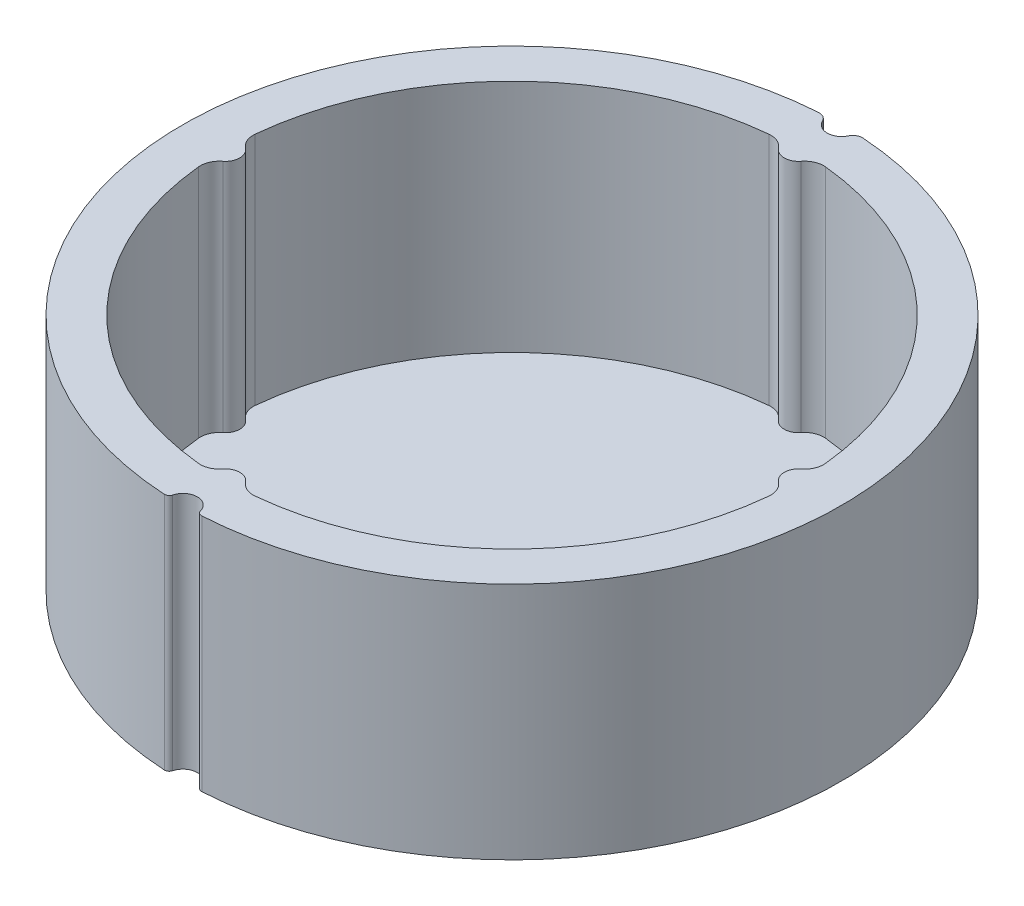
ISO-10303-21;
HEADER;
FILE_DESCRIPTION(('STEP AP214'),'2;1');
FILE_NAME('part.step','',(''),(''),'','','');
FILE_SCHEMA(('AUTOMOTIVE_DESIGN { 1 0 10303 214 1 1 1 1 }'));
ENDSEC;
DATA;
#1=APPLICATION_CONTEXT('core data for automotive mechanical design processes');
#2=APPLICATION_PROTOCOL_DEFINITION('international standard','automotive_design',2000,#1);
#3=PRODUCT_CONTEXT('',#1,'mechanical');
#4=PRODUCT('Part','Part','',(#3));
#5=PRODUCT_RELATED_PRODUCT_CATEGORY('part','',(#4));
#6=PRODUCT_DEFINITION_FORMATION('','',#4);
#7=PRODUCT_DEFINITION_CONTEXT('part definition',#1,'design');
#8=PRODUCT_DEFINITION('design','',#6,#7);
#9=PRODUCT_DEFINITION_SHAPE('','',#8);
#10=(LENGTH_UNIT() NAMED_UNIT(*) SI_UNIT(.MILLI.,.METRE.));
#11=(NAMED_UNIT(*) PLANE_ANGLE_UNIT() SI_UNIT($,.RADIAN.));
#12=(NAMED_UNIT(*) SI_UNIT($,.STERADIAN.) SOLID_ANGLE_UNIT());
#13=UNCERTAINTY_MEASURE_WITH_UNIT(LENGTH_MEASURE(1.E-05),#10,'distance_accuracy_value','');
#14=(GEOMETRIC_REPRESENTATION_CONTEXT(3) GLOBAL_UNCERTAINTY_ASSIGNED_CONTEXT((#13)) GLOBAL_UNIT_ASSIGNED_CONTEXT((#10,
#11,#12)) REPRESENTATION_CONTEXT('',''));
#15=CARTESIAN_POINT('',(0.,0.,0.));
#16=DIRECTION('',(0.,0.,1.));
#17=DIRECTION('',(1.,0.,0.));
#18=AXIS2_PLACEMENT_3D('',#15,#16,#17);
#19=CARTESIAN_POINT('',(0.,25.,0.));
#20=DIRECTION('',(0.,1.,0.));
#21=DIRECTION('',(0.,0.,1.));
#22=AXIS2_PLACEMENT_3D('',#19,#20,#21);
#23=PLANE('',#22);
#24=CARTESIAN_POINT('',(-1.93575856721061,25.,33.9428491683965));
#25=DIRECTION('',(0.,1.,0.));
#26=DIRECTION('',(0.,0.,1.));
#27=AXIS2_PLACEMENT_3D('',#24,#25,#26);
#28=CIRCLE('',#27,0.500000000000003);
#29=CARTESIAN_POINT('',(-1.45181892540796,25.,34.0685568574689));
#30=VERTEX_POINT('',#29);
#31=CARTESIAN_POINT('',(-1.96422560496371,25.,34.4420381383884));
#32=VERTEX_POINT('',#31);
#33=EDGE_CURVE('E338',#30,#32,#28,.F.);
#34=ORIENTED_EDGE('',*,*,#33,.F.);
#35=CARTESIAN_POINT('',(0.,25.,34.4456799246862));
#36=DIRECTION('',(0.,1.,0.));
#37=DIRECTION('',(0.,0.,1.));
#38=AXIS2_PLACEMENT_3D('',#35,#36,#37);
#39=CIRCLE('',#38,1.50000000000002);
#40=CARTESIAN_POINT('',(1.45181892540796,25.,34.0685568574689));
#41=VERTEX_POINT('',#40);
#42=EDGE_CURVE('E342',#41,#30,#39,.T.);
#43=ORIENTED_EDGE('',*,*,#42,.F.);
#44=CARTESIAN_POINT('',(1.93575856721061,25.,33.9428491683965));
#45=DIRECTION('',(0.,1.,0.));
#46=DIRECTION('',(0.,0.,1.));
#47=AXIS2_PLACEMENT_3D('',#44,#45,#46);
#48=CIRCLE('',#47,0.500000000000003);
#49=CARTESIAN_POINT('',(1.9642256049637,25.,34.4420381383884));
#50=VERTEX_POINT('',#49);
#51=EDGE_CURVE('E347',#41,#50,#48,.T.);
#52=ORIENTED_EDGE('',*,*,#51,.T.);
#53=CARTESIAN_POINT('',(0.,25.,-0.0020007910519898));
#54=DIRECTION('',(0.,1.,0.));
#55=DIRECTION('',(0.,0.,1.));
#56=AXIS2_PLACEMENT_3D('',#53,#54,#55);
#57=CIRCLE('',#56,34.5);
#58=CARTESIAN_POINT('',(2.32413582105506,25.,-34.4236276074198));
#59=VERTEX_POINT('',#58);
#60=EDGE_CURVE('E350',#50,#59,#57,.T.);
#61=ORIENTED_EDGE('',*,*,#60,.T.);
#62=CARTESIAN_POINT('',(2.2567695653723,25.,-33.4258992939019));
#63=DIRECTION('',(0.,1.,0.));
#64=DIRECTION('',(0.,0.,1.));
#65=AXIS2_PLACEMENT_3D('',#62,#63,#64);
#66=CIRCLE('',#65,1.);
#67=CARTESIAN_POINT('',(1.35406173922335,25.,-33.8561533823304));
#68=VERTEX_POINT('',#67);
#69=EDGE_CURVE('E353',#68,#59,#66,.F.);
#70=ORIENTED_EDGE('',*,*,#69,.F.);
#71=CARTESIAN_POINT('',(0.,25.,-34.5015345149731));
#72=DIRECTION('',(0.,1.,0.));
#73=DIRECTION('',(0.,0.,1.));
#74=AXIS2_PLACEMENT_3D('',#71,#72,#73);
#75=CIRCLE('',#74,1.49999999999991);
#76=CARTESIAN_POINT('',(-1.35406173922335,25.,-33.8561533823304));
#77=VERTEX_POINT('',#76);
#78=EDGE_CURVE('E357',#77,#68,#75,.T.);
#79=ORIENTED_EDGE('',*,*,#78,.F.);
#80=CARTESIAN_POINT('',(-2.2567695653723,25.,-33.4258992939019));
#81=DIRECTION('',(0.,1.,0.));
#82=DIRECTION('',(0.,0.,1.));
#83=AXIS2_PLACEMENT_3D('',#80,#81,#82);
#84=CIRCLE('',#83,1.);
#85=CARTESIAN_POINT('',(-2.32413582105505,25.,-34.4236276074198));
#86=VERTEX_POINT('',#85);
#87=EDGE_CURVE('E361',#77,#86,#84,.T.);
#88=ORIENTED_EDGE('',*,*,#87,.T.);
#89=CARTESIAN_POINT('',(0.,25.,-0.0020007910519898));
#90=DIRECTION('',(0.,1.,0.));
#91=DIRECTION('',(0.,0.,1.));
#92=AXIS2_PLACEMENT_3D('',#89,#90,#91);
#93=CIRCLE('',#92,34.5);
#94=EDGE_CURVE('E364',#86,#32,#93,.T.);
#95=ORIENTED_EDGE('',*,*,#94,.T.);
#96=EDGE_LOOP('',(#34,#43,#52,#61,#70,#79,#88,#95));
#97=FACE_BOUND('',#96,.T.);
#98=CARTESIAN_POINT('',(0.,25.,0.));
#99=DIRECTION('',(0.,1.,0.));
#100=DIRECTION('',(0.,0.,1.));
#101=AXIS2_PLACEMENT_3D('',#98,#99,#100);
#102=CIRCLE('',#101,30.);
#103=CARTESIAN_POINT('',(-29.8526785714286,25.,2.96944138028848));
#104=VERTEX_POINT('',#103);
#105=CARTESIAN_POINT('',(-2.96944138028845,25.,29.8526785714286));
#106=VERTEX_POINT('',#105);
#107=EDGE_CURVE('E233',#104,#106,#102,.T.);
#108=ORIENTED_EDGE('',*,*,#107,.F.);
#109=CARTESIAN_POINT('',(-27.8625,25.,2.7714786216026));
#110=DIRECTION('',(0.,1.,0.));
#111=DIRECTION('',(0.,0.,1.));
#112=AXIS2_PLACEMENT_3D('',#109,#110,#111);
#113=CIRCLE('',#112,2.);
#114=CARTESIAN_POINT('',(-29.0839285714286,25.,1.18777655211542));
#115=VERTEX_POINT('',#114);
#116=EDGE_CURVE('E229',#115,#104,#113,.T.);
#117=ORIENTED_EDGE('',*,*,#116,.F.);
#118=CARTESIAN_POINT('',(-30.,25.,0.));
#119=DIRECTION('',(0.,-1.,0.));
#120=DIRECTION('',(0.,0.,1.));
#121=AXIS2_PLACEMENT_3D('',#118,#119,#120);
#122=CIRCLE('',#121,1.50000000000004);
#123=CARTESIAN_POINT('',(-29.0839285714286,25.,-1.18777655211542));
#124=VERTEX_POINT('',#123);
#125=EDGE_CURVE('E211',#124,#115,#122,.T.);
#126=ORIENTED_EDGE('',*,*,#125,.F.);
#127=CARTESIAN_POINT('',(-27.8625,25.,-2.7714786216026));
#128=DIRECTION('',(0.,1.,0.));
#129=DIRECTION('',(0.,0.,-1.));
#130=AXIS2_PLACEMENT_3D('',#127,#128,#129);
#131=CIRCLE('',#130,2.);
#132=CARTESIAN_POINT('',(-29.8526785714286,25.,-2.9694413802885));
#133=VERTEX_POINT('',#132);
#134=EDGE_CURVE('E277',#133,#124,#131,.T.);
#135=ORIENTED_EDGE('',*,*,#134,.F.);
#136=CARTESIAN_POINT('',(0.,25.,0.));
#137=DIRECTION('',(0.,1.,0.));
#138=DIRECTION('',(0.,0.,1.));
#139=AXIS2_PLACEMENT_3D('',#136,#137,#138);
#140=CIRCLE('',#139,30.);
#141=CARTESIAN_POINT('',(-2.96944138028845,25.,-29.8526785714286));
#142=VERTEX_POINT('',#141);
#143=EDGE_CURVE('E274',#142,#133,#140,.T.);
#144=ORIENTED_EDGE('',*,*,#143,.F.);
#145=CARTESIAN_POINT('',(-2.77147862160256,25.,-27.8625));
#146=DIRECTION('',(0.,1.,0.));
#147=DIRECTION('',(0.,0.,1.));
#148=AXIS2_PLACEMENT_3D('',#145,#146,#147);
#149=CIRCLE('',#148,2.);
#150=CARTESIAN_POINT('',(-1.18777655211538,25.,-29.0839285714286));
#151=VERTEX_POINT('',#150);
#152=EDGE_CURVE('E271',#151,#142,#149,.T.);
#153=ORIENTED_EDGE('',*,*,#152,.F.);
#154=CARTESIAN_POINT('',(0.,25.,-30.));
#155=DIRECTION('',(0.,-1.,0.));
#156=DIRECTION('',(0.,0.,1.));
#157=AXIS2_PLACEMENT_3D('',#154,#155,#156);
#158=CIRCLE('',#157,1.5);
#159=CARTESIAN_POINT('',(1.18777655211538,25.,-29.0839285714286));
#160=VERTEX_POINT('',#159);
#161=EDGE_CURVE('E268',#160,#151,#158,.T.);
#162=ORIENTED_EDGE('',*,*,#161,.F.);
#163=CARTESIAN_POINT('',(2.77147862160256,25.,-27.8625));
#164=DIRECTION('',(0.,1.,0.));
#165=DIRECTION('',(0.,0.,-1.));
#166=AXIS2_PLACEMENT_3D('',#163,#164,#165);
#167=CIRCLE('',#166,2.);
#168=CARTESIAN_POINT('',(2.96944138028846,25.,-29.8526785714286));
#169=VERTEX_POINT('',#168);
#170=EDGE_CURVE('E265',#169,#160,#167,.T.);
#171=ORIENTED_EDGE('',*,*,#170,.F.);
#172=CARTESIAN_POINT('',(0.,25.,0.));
#173=DIRECTION('',(0.,1.,0.));
#174=DIRECTION('',(0.,0.,1.));
#175=AXIS2_PLACEMENT_3D('',#172,#173,#174);
#176=CIRCLE('',#175,30.);
#177=CARTESIAN_POINT('',(29.8526785714286,25.,-2.96944138028845));
#178=VERTEX_POINT('',#177);
#179=EDGE_CURVE('E262',#178,#169,#176,.T.);
#180=ORIENTED_EDGE('',*,*,#179,.F.);
#181=CARTESIAN_POINT('',(27.8625,25.,-2.77147862160256));
#182=DIRECTION('',(0.,1.,0.));
#183=DIRECTION('',(0.,0.,1.));
#184=AXIS2_PLACEMENT_3D('',#181,#182,#183);
#185=CIRCLE('',#184,2.);
#186=CARTESIAN_POINT('',(29.0839285714286,25.,-1.18777655211538));
#187=VERTEX_POINT('',#186);
#188=EDGE_CURVE('E259',#187,#178,#185,.T.);
#189=ORIENTED_EDGE('',*,*,#188,.F.);
#190=CARTESIAN_POINT('',(30.,25.,0.));
#191=DIRECTION('',(0.,-1.,0.));
#192=DIRECTION('',(0.,0.,1.));
#193=AXIS2_PLACEMENT_3D('',#190,#191,#192);
#194=CIRCLE('',#193,1.5);
#195=CARTESIAN_POINT('',(29.0839285714286,25.,1.18777655211538));
#196=VERTEX_POINT('',#195);
#197=EDGE_CURVE('E256',#196,#187,#194,.T.);
#198=ORIENTED_EDGE('',*,*,#197,.F.);
#199=CARTESIAN_POINT('',(27.8625,25.,2.77147862160256));
#200=DIRECTION('',(0.,1.,0.));
#201=DIRECTION('',(0.,0.,-1.));
#202=AXIS2_PLACEMENT_3D('',#199,#200,#201);
#203=CIRCLE('',#202,2.);
#204=CARTESIAN_POINT('',(29.8526785714286,25.,2.96944138028846));
#205=VERTEX_POINT('',#204);
#206=EDGE_CURVE('E253',#205,#196,#203,.T.);
#207=ORIENTED_EDGE('',*,*,#206,.F.);
#208=CARTESIAN_POINT('',(0.,25.,0.));
#209=DIRECTION('',(0.,1.,0.));
#210=DIRECTION('',(0.,0.,1.));
#211=AXIS2_PLACEMENT_3D('',#208,#209,#210);
#212=CIRCLE('',#211,30.);
#213=CARTESIAN_POINT('',(2.96944138028845,25.,29.8526785714286));
#214=VERTEX_POINT('',#213);
#215=EDGE_CURVE('E250',#214,#205,#212,.T.);
#216=ORIENTED_EDGE('',*,*,#215,.F.);
#217=CARTESIAN_POINT('',(2.77147862160256,25.,27.8625));
#218=DIRECTION('',(0.,1.,0.));
#219=DIRECTION('',(0.,0.,1.));
#220=AXIS2_PLACEMENT_3D('',#217,#218,#219);
#221=CIRCLE('',#220,2.);
#222=CARTESIAN_POINT('',(1.18777655211538,25.,29.0839285714286));
#223=VERTEX_POINT('',#222);
#224=EDGE_CURVE('E247',#223,#214,#221,.T.);
#225=ORIENTED_EDGE('',*,*,#224,.F.);
#226=CARTESIAN_POINT('',(0.,25.,30.));
#227=DIRECTION('',(0.,-1.,0.));
#228=DIRECTION('',(0.,0.,1.));
#229=AXIS2_PLACEMENT_3D('',#226,#227,#228);
#230=CIRCLE('',#229,1.5);
#231=CARTESIAN_POINT('',(-1.18777655211538,25.,29.0839285714286));
#232=VERTEX_POINT('',#231);
#233=EDGE_CURVE('E244',#232,#223,#230,.T.);
#234=ORIENTED_EDGE('',*,*,#233,.F.);
#235=CARTESIAN_POINT('',(-2.77147862160256,25.,27.8625));
#236=DIRECTION('',(0.,1.,0.));
#237=DIRECTION('',(0.,0.,-1.));
#238=AXIS2_PLACEMENT_3D('',#235,#236,#237);
#239=CIRCLE('',#238,2.);
#240=EDGE_CURVE('E241',#106,#232,#239,.T.);
#241=ORIENTED_EDGE('',*,*,#240,.F.);
#242=EDGE_LOOP('',(#108,#117,#126,#135,#144,#153,#162,#171,#180,#189,#198,#207,#216,#225,#234,#241));
#243=FACE_BOUND('',#242,.T.);
#244=ADVANCED_FACE('F41',(#97,#243),#23,.T.);
#245=CARTESIAN_POINT('',(0.,0.,0.));
#246=DIRECTION('',(0.,1.,0.));
#247=DIRECTION('',(0.,0.,1.));
#248=AXIS2_PLACEMENT_3D('',#245,#246,#247);
#249=PLANE('',#248);
#250=CARTESIAN_POINT('',(-1.93575856721061,0.,33.9428491683965));
#251=DIRECTION('',(0.,1.,0.));
#252=DIRECTION('',(0.,0.,1.));
#253=AXIS2_PLACEMENT_3D('',#250,#251,#252);
#254=CIRCLE('',#253,0.500000000000003);
#255=CARTESIAN_POINT('',(-1.45181892540796,0.,34.0685568574689));
#256=VERTEX_POINT('',#255);
#257=CARTESIAN_POINT('',(-1.96422560496371,0.,34.4420381383884));
#258=VERTEX_POINT('',#257);
#259=EDGE_CURVE('E337',#256,#258,#254,.F.);
#260=ORIENTED_EDGE('',*,*,#259,.T.);
#261=CARTESIAN_POINT('',(0.,0.,-0.0020007910519898));
#262=DIRECTION('',(0.,1.,0.));
#263=DIRECTION('',(0.,0.,1.));
#264=AXIS2_PLACEMENT_3D('',#261,#262,#263);
#265=CIRCLE('',#264,34.5);
#266=CARTESIAN_POINT('',(-2.32413582105505,0.,-34.4236276074198));
#267=VERTEX_POINT('',#266);
#268=EDGE_CURVE('E343',#267,#258,#265,.T.);
#269=ORIENTED_EDGE('',*,*,#268,.F.);
#270=CARTESIAN_POINT('',(-2.2567695653723,0.,-33.4258992939019));
#271=DIRECTION('',(0.,1.,0.));
#272=DIRECTION('',(0.,0.,1.));
#273=AXIS2_PLACEMENT_3D('',#270,#271,#272);
#274=CIRCLE('',#273,1.);
#275=CARTESIAN_POINT('',(-1.35406173922335,0.,-33.8561533823304));
#276=VERTEX_POINT('',#275);
#277=EDGE_CURVE('E390',#276,#267,#274,.T.);
#278=ORIENTED_EDGE('',*,*,#277,.F.);
#279=CARTESIAN_POINT('',(0.,0.,-34.5015345149731));
#280=DIRECTION('',(0.,1.,0.));
#281=DIRECTION('',(0.,0.,1.));
#282=AXIS2_PLACEMENT_3D('',#279,#280,#281);
#283=CIRCLE('',#282,1.49999999999991);
#284=CARTESIAN_POINT('',(1.35406173922335,0.,-33.8561533823304));
#285=VERTEX_POINT('',#284);
#286=EDGE_CURVE('E386',#276,#285,#283,.T.);
#287=ORIENTED_EDGE('',*,*,#286,.T.);
#288=CARTESIAN_POINT('',(2.2567695653723,0.,-33.4258992939019));
#289=DIRECTION('',(0.,1.,0.));
#290=DIRECTION('',(0.,0.,1.));
#291=AXIS2_PLACEMENT_3D('',#288,#289,#290);
#292=CIRCLE('',#291,1.);
#293=CARTESIAN_POINT('',(2.32413582105506,0.,-34.4236276074198));
#294=VERTEX_POINT('',#293);
#295=EDGE_CURVE('E382',#285,#294,#292,.F.);
#296=ORIENTED_EDGE('',*,*,#295,.T.);
#297=CARTESIAN_POINT('',(0.,0.,-0.0020007910519898));
#298=DIRECTION('',(0.,1.,0.));
#299=DIRECTION('',(0.,0.,1.));
#300=AXIS2_PLACEMENT_3D('',#297,#298,#299);
#301=CIRCLE('',#300,34.5);
#302=CARTESIAN_POINT('',(1.9642256049637,0.,34.4420381383884));
#303=VERTEX_POINT('',#302);
#304=EDGE_CURVE('E378',#303,#294,#301,.T.);
#305=ORIENTED_EDGE('',*,*,#304,.F.);
#306=CARTESIAN_POINT('',(1.93575856721061,0.,33.9428491683965));
#307=DIRECTION('',(0.,1.,0.));
#308=DIRECTION('',(0.,0.,1.));
#309=AXIS2_PLACEMENT_3D('',#306,#307,#308);
#310=CIRCLE('',#309,0.500000000000003);
#311=CARTESIAN_POINT('',(1.45181892540796,0.,34.0685568574689));
#312=VERTEX_POINT('',#311);
#313=EDGE_CURVE('E375',#312,#303,#310,.T.);
#314=ORIENTED_EDGE('',*,*,#313,.F.);
#315=CARTESIAN_POINT('',(0.,0.,34.4456799246862));
#316=DIRECTION('',(0.,1.,0.));
#317=DIRECTION('',(0.,0.,1.));
#318=AXIS2_PLACEMENT_3D('',#315,#316,#317);
#319=CIRCLE('',#318,1.50000000000002);
#320=EDGE_CURVE('E371',#312,#256,#319,.T.);
#321=ORIENTED_EDGE('',*,*,#320,.T.);
#322=EDGE_LOOP('',(#260,#269,#278,#287,#296,#305,#314,#321));
#323=FACE_BOUND('',#322,.T.);
#324=ADVANCED_FACE('F425',(#323),#249,.F.);
#325=CARTESIAN_POINT('',(-1.93575856721061,25.,33.9428491683965));
#326=DIRECTION('',(0.,-1.,0.));
#327=DIRECTION('',(0.,0.,-1.));
#328=AXIS2_PLACEMENT_3D('',#325,#326,#327);
#329=CYLINDRICAL_SURFACE('',#328,0.500000000000003);
#330=ORIENTED_EDGE('',*,*,#259,.F.);
#331=DIRECTION('',(0.,-1.,0.));
#332=VECTOR('',#331,1.);
#333=CARTESIAN_POINT('',(-1.45181892540796,25.,34.0685568574689));
#334=LINE('',#333,#332);
#335=EDGE_CURVE('E11',#30,#256,#334,.T.);
#336=ORIENTED_EDGE('',*,*,#335,.F.);
#337=ORIENTED_EDGE('',*,*,#33,.T.);
#338=DIRECTION('',(0.,-1.,0.));
#339=VECTOR('',#338,1.);
#340=CARTESIAN_POINT('',(-1.96422560496371,25.,34.4420381383884));
#341=LINE('',#340,#339);
#342=EDGE_CURVE('E367',#32,#258,#341,.T.);
#343=ORIENTED_EDGE('',*,*,#342,.T.);
#344=EDGE_LOOP('',(#330,#336,#337,#343));
#345=FACE_BOUND('',#344,.T.);
#346=ADVANCED_FACE('F43',(#345),#329,.T.);
#347=CARTESIAN_POINT('',(0.,25.,34.4456799246862));
#348=DIRECTION('',(0.,-1.,0.));
#349=DIRECTION('',(0.,0.,-1.));
#350=AXIS2_PLACEMENT_3D('',#347,#348,#349);
#351=CYLINDRICAL_SURFACE('',#350,1.50000000000002);
#352=ORIENTED_EDGE('',*,*,#320,.F.);
#353=DIRECTION('',(0.,-1.,0.));
#354=VECTOR('',#353,1.);
#355=CARTESIAN_POINT('',(1.45181892540796,25.,34.0685568574689));
#356=LINE('',#355,#354);
#357=EDGE_CURVE('E50',#41,#312,#356,.T.);
#358=ORIENTED_EDGE('',*,*,#357,.F.);
#359=ORIENTED_EDGE('',*,*,#42,.T.);
#360=ORIENTED_EDGE('',*,*,#335,.T.);
#361=EDGE_LOOP('',(#352,#358,#359,#360));
#362=FACE_BOUND('',#361,.T.);
#363=ADVANCED_FACE('F426',(#362),#351,.F.);
#364=CARTESIAN_POINT('',(1.93575856721061,25.,33.9428491683965));
#365=DIRECTION('',(0.,-1.,0.));
#366=DIRECTION('',(0.,0.,-1.));
#367=AXIS2_PLACEMENT_3D('',#364,#365,#366);
#368=CYLINDRICAL_SURFACE('',#367,0.500000000000003);
#369=ORIENTED_EDGE('',*,*,#313,.T.);
#370=DIRECTION('',(0.,-1.,0.));
#371=VECTOR('',#370,1.);
#372=CARTESIAN_POINT('',(1.9642256049637,25.,34.4420381383884));
#373=LINE('',#372,#371);
#374=EDGE_CURVE('E411',#50,#303,#373,.T.);
#375=ORIENTED_EDGE('',*,*,#374,.F.);
#376=ORIENTED_EDGE('',*,*,#51,.F.);
#377=ORIENTED_EDGE('',*,*,#357,.T.);
#378=EDGE_LOOP('',(#369,#375,#376,#377));
#379=FACE_BOUND('',#378,.T.);
#380=ADVANCED_FACE('F418',(#379),#368,.T.);
#381=CARTESIAN_POINT('',(0.,25.,-0.0020007910519898));
#382=DIRECTION('',(0.,-1.,0.));
#383=DIRECTION('',(0.,0.,-1.));
#384=AXIS2_PLACEMENT_3D('',#381,#382,#383);
#385=CYLINDRICAL_SURFACE('',#384,34.5);
#386=ORIENTED_EDGE('',*,*,#304,.T.);
#387=DIRECTION('',(0.,-1.,0.));
#388=VECTOR('',#387,1.);
#389=CARTESIAN_POINT('',(2.32413582105506,25.,-34.4236276074198));
#390=LINE('',#389,#388);
#391=EDGE_CURVE('E408',#59,#294,#390,.T.);
#392=ORIENTED_EDGE('',*,*,#391,.F.);
#393=ORIENTED_EDGE('',*,*,#60,.F.);
#394=ORIENTED_EDGE('',*,*,#374,.T.);
#395=EDGE_LOOP('',(#386,#392,#393,#394));
#396=FACE_BOUND('',#395,.T.);
#397=ADVANCED_FACE('F451',(#396),#385,.T.);
#398=CARTESIAN_POINT('',(2.2567695653723,25.,-33.4258992939019));
#399=DIRECTION('',(0.,-1.,0.));
#400=DIRECTION('',(0.,0.,-1.));
#401=AXIS2_PLACEMENT_3D('',#398,#399,#400);
#402=CYLINDRICAL_SURFACE('',#401,1.);
#403=ORIENTED_EDGE('',*,*,#295,.F.);
#404=DIRECTION('',(0.,-1.,0.));
#405=VECTOR('',#404,1.);
#406=CARTESIAN_POINT('',(1.35406173922335,25.,-33.8561533823304));
#407=LINE('',#406,#405);
#408=EDGE_CURVE('E405',#68,#285,#407,.T.);
#409=ORIENTED_EDGE('',*,*,#408,.F.);
#410=ORIENTED_EDGE('',*,*,#69,.T.);
#411=ORIENTED_EDGE('',*,*,#391,.T.);
#412=EDGE_LOOP('',(#403,#409,#410,#411));
#413=FACE_BOUND('',#412,.T.);
#414=ADVANCED_FACE('F446',(#413),#402,.T.);
#415=CARTESIAN_POINT('',(0.,25.,-34.5015345149731));
#416=DIRECTION('',(0.,-1.,0.));
#417=DIRECTION('',(0.,0.,-1.));
#418=AXIS2_PLACEMENT_3D('',#415,#416,#417);
#419=CYLINDRICAL_SURFACE('',#418,1.49999999999991);
#420=ORIENTED_EDGE('',*,*,#286,.F.);
#421=DIRECTION('',(0.,-1.,0.));
#422=VECTOR('',#421,1.);
#423=CARTESIAN_POINT('',(-1.35406173922335,25.,-33.8561533823304));
#424=LINE('',#423,#422);
#425=EDGE_CURVE('E402',#77,#276,#424,.T.);
#426=ORIENTED_EDGE('',*,*,#425,.F.);
#427=ORIENTED_EDGE('',*,*,#78,.T.);
#428=ORIENTED_EDGE('',*,*,#408,.T.);
#429=EDGE_LOOP('',(#420,#426,#427,#428));
#430=FACE_BOUND('',#429,.T.);
#431=ADVANCED_FACE('F443',(#430),#419,.F.);
#432=CARTESIAN_POINT('',(-2.2567695653723,25.,-33.4258992939019));
#433=DIRECTION('',(0.,-1.,0.));
#434=DIRECTION('',(0.,0.,-1.));
#435=AXIS2_PLACEMENT_3D('',#432,#433,#434);
#436=CYLINDRICAL_SURFACE('',#435,1.);
#437=ORIENTED_EDGE('',*,*,#277,.T.);
#438=DIRECTION('',(0.,-1.,0.));
#439=VECTOR('',#438,1.);
#440=CARTESIAN_POINT('',(-2.32413582105505,25.,-34.4236276074198));
#441=LINE('',#440,#439);
#442=EDGE_CURVE('E398',#86,#267,#441,.T.);
#443=ORIENTED_EDGE('',*,*,#442,.F.);
#444=ORIENTED_EDGE('',*,*,#87,.F.);
#445=ORIENTED_EDGE('',*,*,#425,.T.);
#446=EDGE_LOOP('',(#437,#443,#444,#445));
#447=FACE_BOUND('',#446,.T.);
#448=ADVANCED_FACE('F440',(#447),#436,.T.);
#449=CARTESIAN_POINT('',(0.,25.,-0.0020007910519898));
#450=DIRECTION('',(0.,-1.,0.));
#451=DIRECTION('',(0.,0.,-1.));
#452=AXIS2_PLACEMENT_3D('',#449,#450,#451);
#453=CYLINDRICAL_SURFACE('',#452,34.5);
#454=ORIENTED_EDGE('',*,*,#268,.T.);
#455=ORIENTED_EDGE('',*,*,#342,.F.);
#456=ORIENTED_EDGE('',*,*,#94,.F.);
#457=ORIENTED_EDGE('',*,*,#442,.T.);
#458=EDGE_LOOP('',(#454,#455,#456,#457));
#459=FACE_BOUND('',#458,.T.);
#460=ADVANCED_FACE('F435',(#459),#453,.T.);
#461=CARTESIAN_POINT('',(-27.8625,25.,2.7714786216026));
#462=DIRECTION('',(0.,-1.,0.));
#463=DIRECTION('',(0.,0.,-1.));
#464=AXIS2_PLACEMENT_3D('',#461,#462,#463);
#465=CYLINDRICAL_SURFACE('',#464,2.);
#466=CARTESIAN_POINT('',(-27.8625,0.4,2.7714786216026));
#467=DIRECTION('',(0.,1.,0.));
#468=DIRECTION('',(0.,0.,1.));
#469=AXIS2_PLACEMENT_3D('',#466,#467,#468);
#470=CIRCLE('',#469,2.);
#471=CARTESIAN_POINT('',(-29.0839285714286,0.4,1.18777655211542));
#472=VERTEX_POINT('',#471);
#473=CARTESIAN_POINT('',(-29.8526785714286,0.400000000000001,2.96944138028848));
#474=VERTEX_POINT('',#473);
#475=EDGE_CURVE('E218',#472,#474,#470,.T.);
#476=ORIENTED_EDGE('',*,*,#475,.F.);
#477=DIRECTION('',(0.,-1.,0.));
#478=VECTOR('',#477,1.);
#479=CARTESIAN_POINT('',(-29.0839285714286,25.,1.18777655211542));
#480=LINE('',#479,#478);
#481=EDGE_CURVE('E204',#115,#472,#480,.T.);
#482=ORIENTED_EDGE('',*,*,#481,.F.);
#483=ORIENTED_EDGE('',*,*,#116,.T.);
#484=DIRECTION('',(0.,-1.,0.));
#485=VECTOR('',#484,1.);
#486=CARTESIAN_POINT('',(-29.8526785714286,25.,2.96944138028848));
#487=LINE('',#486,#485);
#488=EDGE_CURVE('E220',#104,#474,#487,.T.);
#489=ORIENTED_EDGE('',*,*,#488,.T.);
#490=EDGE_LOOP('',(#476,#482,#483,#489));
#491=FACE_BOUND('',#490,.T.);
#492=ADVANCED_FACE('F219',(#491),#465,.F.);
#493=CARTESIAN_POINT('',(0.,25.,0.));
#494=DIRECTION('',(0.,-1.,0.));
#495=DIRECTION('',(0.,0.,-1.));
#496=AXIS2_PLACEMENT_3D('',#493,#494,#495);
#497=CYLINDRICAL_SURFACE('',#496,30.);
#498=CARTESIAN_POINT('',(0.,0.4,0.));
#499=DIRECTION('',(0.,1.,0.));
#500=DIRECTION('',(0.,0.,1.));
#501=AXIS2_PLACEMENT_3D('',#498,#499,#500);
#502=CIRCLE('',#501,30.);
#503=CARTESIAN_POINT('',(-2.96944138028845,0.400000000000001,29.8526785714286));
#504=VERTEX_POINT('',#503);
#505=EDGE_CURVE('E57',#474,#504,#502,.T.);
#506=ORIENTED_EDGE('',*,*,#505,.F.);
#507=ORIENTED_EDGE('',*,*,#488,.F.);
#508=ORIENTED_EDGE('',*,*,#107,.T.);
#509=DIRECTION('',(0.,-1.,0.));
#510=VECTOR('',#509,1.);
#511=CARTESIAN_POINT('',(-2.96944138028845,25.,29.8526785714286));
#512=LINE('',#511,#510);
#513=EDGE_CURVE('E332',#106,#504,#512,.T.);
#514=ORIENTED_EDGE('',*,*,#513,.T.);
#515=EDGE_LOOP('',(#506,#507,#508,#514));
#516=FACE_BOUND('',#515,.T.);
#517=ADVANCED_FACE('F459',(#516),#497,.F.);
#518=CARTESIAN_POINT('',(-2.77147862160256,25.,27.8625));
#519=DIRECTION('',(0.,-1.,0.));
#520=DIRECTION('',(0.,0.,-1.));
#521=AXIS2_PLACEMENT_3D('',#518,#519,#520);
#522=CYLINDRICAL_SURFACE('',#521,2.);
#523=CARTESIAN_POINT('',(-2.77147862160256,0.4,27.8625));
#524=DIRECTION('',(0.,1.,0.));
#525=DIRECTION('',(0.,0.,-1.));
#526=AXIS2_PLACEMENT_3D('',#523,#524,#525);
#527=CIRCLE('',#526,2.);
#528=CARTESIAN_POINT('',(-1.18777655211538,0.400000000000001,29.0839285714286));
#529=VERTEX_POINT('',#528);
#530=EDGE_CURVE('E65',#504,#529,#527,.T.);
#531=ORIENTED_EDGE('',*,*,#530,.F.);
#532=ORIENTED_EDGE('',*,*,#513,.F.);
#533=ORIENTED_EDGE('',*,*,#240,.T.);
#534=DIRECTION('',(0.,-1.,0.));
#535=VECTOR('',#534,1.);
#536=CARTESIAN_POINT('',(-1.18777655211538,25.,29.0839285714286));
#537=LINE('',#536,#535);
#538=EDGE_CURVE('E329',#232,#529,#537,.T.);
#539=ORIENTED_EDGE('',*,*,#538,.T.);
#540=EDGE_LOOP('',(#531,#532,#533,#539));
#541=FACE_BOUND('',#540,.T.);
#542=ADVANCED_FACE('F460',(#541),#522,.F.);
#543=CARTESIAN_POINT('',(0.,25.,30.));
#544=DIRECTION('',(0.,-1.,0.));
#545=DIRECTION('',(0.,0.,-1.));
#546=AXIS2_PLACEMENT_3D('',#543,#544,#545);
#547=CYLINDRICAL_SURFACE('',#546,1.5);
#548=CARTESIAN_POINT('',(0.,0.4,30.));
#549=DIRECTION('',(0.,-1.,0.));
#550=DIRECTION('',(0.,0.,1.));
#551=AXIS2_PLACEMENT_3D('',#548,#549,#550);
#552=CIRCLE('',#551,1.5);
#553=CARTESIAN_POINT('',(1.18777655211538,0.400000000000001,29.0839285714286));
#554=VERTEX_POINT('',#553);
#555=EDGE_CURVE('E466',#529,#554,#552,.T.);
#556=ORIENTED_EDGE('',*,*,#555,.F.);
#557=ORIENTED_EDGE('',*,*,#538,.F.);
#558=ORIENTED_EDGE('',*,*,#233,.T.);
#559=DIRECTION('',(0.,-1.,0.));
#560=VECTOR('',#559,1.);
#561=CARTESIAN_POINT('',(1.18777655211538,25.,29.0839285714286));
#562=LINE('',#561,#560);
#563=EDGE_CURVE('E325',#223,#554,#562,.T.);
#564=ORIENTED_EDGE('',*,*,#563,.T.);
#565=EDGE_LOOP('',(#556,#557,#558,#564));
#566=FACE_BOUND('',#565,.T.);
#567=ADVANCED_FACE('F463',(#566),#547,.T.);
#568=CARTESIAN_POINT('',(2.77147862160256,25.,27.8625));
#569=DIRECTION('',(0.,-1.,0.));
#570=DIRECTION('',(0.,0.,-1.));
#571=AXIS2_PLACEMENT_3D('',#568,#569,#570);
#572=CYLINDRICAL_SURFACE('',#571,2.);
#573=CARTESIAN_POINT('',(2.77147862160256,0.4,27.8625));
#574=DIRECTION('',(0.,1.,0.));
#575=DIRECTION('',(0.,0.,1.));
#576=AXIS2_PLACEMENT_3D('',#573,#574,#575);
#577=CIRCLE('',#576,2.);
#578=CARTESIAN_POINT('',(2.96944138028845,0.400000000000001,29.8526785714286));
#579=VERTEX_POINT('',#578);
#580=EDGE_CURVE('E482',#554,#579,#577,.T.);
#581=ORIENTED_EDGE('',*,*,#580,.F.);
#582=ORIENTED_EDGE('',*,*,#563,.F.);
#583=ORIENTED_EDGE('',*,*,#224,.T.);
#584=DIRECTION('',(0.,-1.,0.));
#585=VECTOR('',#584,1.);
#586=CARTESIAN_POINT('',(2.96944138028845,25.,29.8526785714286));
#587=LINE('',#586,#585);
#588=EDGE_CURVE('E321',#214,#579,#587,.T.);
#589=ORIENTED_EDGE('',*,*,#588,.T.);
#590=EDGE_LOOP('',(#581,#582,#583,#589));
#591=FACE_BOUND('',#590,.T.);
#592=ADVANCED_FACE('F472',(#591),#572,.F.);
#593=CARTESIAN_POINT('',(0.,25.,0.));
#594=DIRECTION('',(0.,-1.,0.));
#595=DIRECTION('',(0.,0.,-1.));
#596=AXIS2_PLACEMENT_3D('',#593,#594,#595);
#597=CYLINDRICAL_SURFACE('',#596,30.);
#598=CARTESIAN_POINT('',(0.,0.4,0.));
#599=DIRECTION('',(0.,1.,0.));
#600=DIRECTION('',(0.,0.,1.));
#601=AXIS2_PLACEMENT_3D('',#598,#599,#600);
#602=CIRCLE('',#601,30.);
#603=CARTESIAN_POINT('',(29.8526785714286,0.400000000000001,2.96944138028846));
#604=VERTEX_POINT('',#603);
#605=EDGE_CURVE('E478',#579,#604,#602,.T.);
#606=ORIENTED_EDGE('',*,*,#605,.F.);
#607=ORIENTED_EDGE('',*,*,#588,.F.);
#608=ORIENTED_EDGE('',*,*,#215,.T.);
#609=DIRECTION('',(0.,-1.,0.));
#610=VECTOR('',#609,1.);
#611=CARTESIAN_POINT('',(29.8526785714286,25.,2.96944138028846));
#612=LINE('',#611,#610);
#613=EDGE_CURVE('E317',#205,#604,#612,.T.);
#614=ORIENTED_EDGE('',*,*,#613,.T.);
#615=EDGE_LOOP('',(#606,#607,#608,#614));
#616=FACE_BOUND('',#615,.T.);
#617=ADVANCED_FACE('F475',(#616),#597,.F.);
#618=CARTESIAN_POINT('',(27.8625,25.,2.77147862160256));
#619=DIRECTION('',(0.,-1.,0.));
#620=DIRECTION('',(0.,0.,-1.));
#621=AXIS2_PLACEMENT_3D('',#618,#619,#620);
#622=CYLINDRICAL_SURFACE('',#621,2.);
#623=CARTESIAN_POINT('',(27.8625,0.4,2.77147862160256));
#624=DIRECTION('',(0.,1.,0.));
#625=DIRECTION('',(0.,0.,-1.));
#626=AXIS2_PLACEMENT_3D('',#623,#624,#625);
#627=CIRCLE('',#626,2.);
#628=CARTESIAN_POINT('',(29.0839285714286,0.400000000000001,1.18777655211538));
#629=VERTEX_POINT('',#628);
#630=EDGE_CURVE('E481',#604,#629,#627,.T.);
#631=ORIENTED_EDGE('',*,*,#630,.F.);
#632=ORIENTED_EDGE('',*,*,#613,.F.);
#633=ORIENTED_EDGE('',*,*,#206,.T.);
#634=DIRECTION('',(0.,-1.,0.));
#635=VECTOR('',#634,1.);
#636=CARTESIAN_POINT('',(29.0839285714286,25.,1.18777655211538));
#637=LINE('',#636,#635);
#638=EDGE_CURVE('E313',#196,#629,#637,.T.);
#639=ORIENTED_EDGE('',*,*,#638,.T.);
#640=EDGE_LOOP('',(#631,#632,#633,#639));
#641=FACE_BOUND('',#640,.T.);
#642=ADVANCED_FACE('F559',(#641),#622,.F.);
#643=CARTESIAN_POINT('',(30.,25.,0.));
#644=DIRECTION('',(0.,-1.,0.));
#645=DIRECTION('',(0.,0.,-1.));
#646=AXIS2_PLACEMENT_3D('',#643,#644,#645);
#647=CYLINDRICAL_SURFACE('',#646,1.5);
#648=CARTESIAN_POINT('',(30.,0.4,0.));
#649=DIRECTION('',(0.,-1.,0.));
#650=DIRECTION('',(0.,0.,1.));
#651=AXIS2_PLACEMENT_3D('',#648,#649,#650);
#652=CIRCLE('',#651,1.5);
#653=CARTESIAN_POINT('',(29.0839285714286,0.400000000000001,-1.18777655211538));
#654=VERTEX_POINT('',#653);
#655=EDGE_CURVE('E486',#629,#654,#652,.T.);
#656=ORIENTED_EDGE('',*,*,#655,.F.);
#657=ORIENTED_EDGE('',*,*,#638,.F.);
#658=ORIENTED_EDGE('',*,*,#197,.T.);
#659=DIRECTION('',(0.,-1.,0.));
#660=VECTOR('',#659,1.);
#661=CARTESIAN_POINT('',(29.0839285714286,25.,-1.18777655211538));
#662=LINE('',#661,#660);
#663=EDGE_CURVE('E309',#187,#654,#662,.T.);
#664=ORIENTED_EDGE('',*,*,#663,.T.);
#665=EDGE_LOOP('',(#656,#657,#658,#664));
#666=FACE_BOUND('',#665,.T.);
#667=ADVANCED_FACE('F555',(#666),#647,.T.);
#668=CARTESIAN_POINT('',(27.8625,25.,-2.77147862160256));
#669=DIRECTION('',(0.,-1.,0.));
#670=DIRECTION('',(0.,0.,-1.));
#671=AXIS2_PLACEMENT_3D('',#668,#669,#670);
#672=CYLINDRICAL_SURFACE('',#671,2.);
#673=CARTESIAN_POINT('',(27.8625,0.4,-2.77147862160256));
#674=DIRECTION('',(0.,1.,0.));
#675=DIRECTION('',(0.,0.,1.));
#676=AXIS2_PLACEMENT_3D('',#673,#674,#675);
#677=CIRCLE('',#676,2.);
#678=CARTESIAN_POINT('',(29.8526785714286,0.400000000000001,-2.96944138028845));
#679=VERTEX_POINT('',#678);
#680=EDGE_CURVE('E494',#654,#679,#677,.T.);
#681=ORIENTED_EDGE('',*,*,#680,.F.);
#682=ORIENTED_EDGE('',*,*,#663,.F.);
#683=ORIENTED_EDGE('',*,*,#188,.T.);
#684=DIRECTION('',(0.,-1.,0.));
#685=VECTOR('',#684,1.);
#686=CARTESIAN_POINT('',(29.8526785714286,25.,-2.96944138028845));
#687=LINE('',#686,#685);
#688=EDGE_CURVE('E305',#178,#679,#687,.T.);
#689=ORIENTED_EDGE('',*,*,#688,.T.);
#690=EDGE_LOOP('',(#681,#682,#683,#689));
#691=FACE_BOUND('',#690,.T.);
#692=ADVANCED_FACE('F551',(#691),#672,.F.);
#693=CARTESIAN_POINT('',(0.,25.,0.));
#694=DIRECTION('',(0.,-1.,0.));
#695=DIRECTION('',(0.,0.,-1.));
#696=AXIS2_PLACEMENT_3D('',#693,#694,#695);
#697=CYLINDRICAL_SURFACE('',#696,30.);
#698=CARTESIAN_POINT('',(0.,0.4,0.));
#699=DIRECTION('',(0.,1.,0.));
#700=DIRECTION('',(0.,0.,1.));
#701=AXIS2_PLACEMENT_3D('',#698,#699,#700);
#702=CIRCLE('',#701,30.);
#703=CARTESIAN_POINT('',(2.96944138028846,0.400000000000001,-29.8526785714286));
#704=VERTEX_POINT('',#703);
#705=EDGE_CURVE('E498',#679,#704,#702,.T.);
#706=ORIENTED_EDGE('',*,*,#705,.F.);
#707=ORIENTED_EDGE('',*,*,#688,.F.);
#708=ORIENTED_EDGE('',*,*,#179,.T.);
#709=DIRECTION('',(0.,-1.,0.));
#710=VECTOR('',#709,1.);
#711=CARTESIAN_POINT('',(2.96944138028846,25.,-29.8526785714286));
#712=LINE('',#711,#710);
#713=EDGE_CURVE('E301',#169,#704,#712,.T.);
#714=ORIENTED_EDGE('',*,*,#713,.T.);
#715=EDGE_LOOP('',(#706,#707,#708,#714));
#716=FACE_BOUND('',#715,.T.);
#717=ADVANCED_FACE('F547',(#716),#697,.F.);
#718=CARTESIAN_POINT('',(2.77147862160256,25.,-27.8625));
#719=DIRECTION('',(0.,-1.,0.));
#720=DIRECTION('',(0.,0.,-1.));
#721=AXIS2_PLACEMENT_3D('',#718,#719,#720);
#722=CYLINDRICAL_SURFACE('',#721,2.);
#723=CARTESIAN_POINT('',(2.77147862160256,0.4,-27.8625));
#724=DIRECTION('',(0.,1.,0.));
#725=DIRECTION('',(0.,0.,-1.));
#726=AXIS2_PLACEMENT_3D('',#723,#724,#725);
#727=CIRCLE('',#726,2.);
#728=CARTESIAN_POINT('',(1.18777655211538,0.400000000000001,-29.0839285714286));
#729=VERTEX_POINT('',#728);
#730=EDGE_CURVE('E502',#704,#729,#727,.T.);
#731=ORIENTED_EDGE('',*,*,#730,.F.);
#732=ORIENTED_EDGE('',*,*,#713,.F.);
#733=ORIENTED_EDGE('',*,*,#170,.T.);
#734=DIRECTION('',(0.,-1.,0.));
#735=VECTOR('',#734,1.);
#736=CARTESIAN_POINT('',(1.18777655211538,25.,-29.0839285714286));
#737=LINE('',#736,#735);
#738=EDGE_CURVE('E297',#160,#729,#737,.T.);
#739=ORIENTED_EDGE('',*,*,#738,.T.);
#740=EDGE_LOOP('',(#731,#732,#733,#739));
#741=FACE_BOUND('',#740,.T.);
#742=ADVANCED_FACE('F543',(#741),#722,.F.);
#743=CARTESIAN_POINT('',(0.,25.,-30.));
#744=DIRECTION('',(0.,-1.,0.));
#745=DIRECTION('',(0.,0.,-1.));
#746=AXIS2_PLACEMENT_3D('',#743,#744,#745);
#747=CYLINDRICAL_SURFACE('',#746,1.5);
#748=CARTESIAN_POINT('',(0.,0.4,-30.));
#749=DIRECTION('',(0.,-1.,0.));
#750=DIRECTION('',(0.,0.,1.));
#751=AXIS2_PLACEMENT_3D('',#748,#749,#750);
#752=CIRCLE('',#751,1.5);
#753=CARTESIAN_POINT('',(-1.18777655211538,0.400000000000001,-29.0839285714286));
#754=VERTEX_POINT('',#753);
#755=EDGE_CURVE('E506',#729,#754,#752,.T.);
#756=ORIENTED_EDGE('',*,*,#755,.F.);
#757=ORIENTED_EDGE('',*,*,#738,.F.);
#758=ORIENTED_EDGE('',*,*,#161,.T.);
#759=DIRECTION('',(0.,-1.,0.));
#760=VECTOR('',#759,1.);
#761=CARTESIAN_POINT('',(-1.18777655211538,25.,-29.0839285714286));
#762=LINE('',#761,#760);
#763=EDGE_CURVE('E293',#151,#754,#762,.T.);
#764=ORIENTED_EDGE('',*,*,#763,.T.);
#765=EDGE_LOOP('',(#756,#757,#758,#764));
#766=FACE_BOUND('',#765,.T.);
#767=ADVANCED_FACE('F540',(#766),#747,.T.);
#768=CARTESIAN_POINT('',(-2.77147862160256,25.,-27.8625));
#769=DIRECTION('',(0.,-1.,0.));
#770=DIRECTION('',(0.,0.,-1.));
#771=AXIS2_PLACEMENT_3D('',#768,#769,#770);
#772=CYLINDRICAL_SURFACE('',#771,2.);
#773=CARTESIAN_POINT('',(-2.77147862160256,0.4,-27.8625));
#774=DIRECTION('',(0.,1.,0.));
#775=DIRECTION('',(0.,0.,1.));
#776=AXIS2_PLACEMENT_3D('',#773,#774,#775);
#777=CIRCLE('',#776,2.);
#778=CARTESIAN_POINT('',(-2.96944138028845,0.400000000000001,-29.8526785714286));
#779=VERTEX_POINT('',#778);
#780=EDGE_CURVE('E510',#754,#779,#777,.T.);
#781=ORIENTED_EDGE('',*,*,#780,.F.);
#782=ORIENTED_EDGE('',*,*,#763,.F.);
#783=ORIENTED_EDGE('',*,*,#152,.T.);
#784=DIRECTION('',(0.,-1.,0.));
#785=VECTOR('',#784,1.);
#786=CARTESIAN_POINT('',(-2.96944138028845,25.,-29.8526785714286));
#787=LINE('',#786,#785);
#788=EDGE_CURVE('E289',#142,#779,#787,.T.);
#789=ORIENTED_EDGE('',*,*,#788,.T.);
#790=EDGE_LOOP('',(#781,#782,#783,#789));
#791=FACE_BOUND('',#790,.T.);
#792=ADVANCED_FACE('F520',(#791),#772,.F.);
#793=CARTESIAN_POINT('',(0.,25.,0.));
#794=DIRECTION('',(0.,-1.,0.));
#795=DIRECTION('',(0.,0.,-1.));
#796=AXIS2_PLACEMENT_3D('',#793,#794,#795);
#797=CYLINDRICAL_SURFACE('',#796,30.);
#798=CARTESIAN_POINT('',(0.,0.4,0.));
#799=DIRECTION('',(0.,1.,0.));
#800=DIRECTION('',(0.,0.,1.));
#801=AXIS2_PLACEMENT_3D('',#798,#799,#800);
#802=CIRCLE('',#801,30.);
#803=CARTESIAN_POINT('',(-29.8526785714286,0.400000000000001,-2.9694413802885));
#804=VERTEX_POINT('',#803);
#805=EDGE_CURVE('E235',#779,#804,#802,.T.);
#806=ORIENTED_EDGE('',*,*,#805,.F.);
#807=ORIENTED_EDGE('',*,*,#788,.F.);
#808=ORIENTED_EDGE('',*,*,#143,.T.);
#809=DIRECTION('',(0.,-1.,0.));
#810=VECTOR('',#809,1.);
#811=CARTESIAN_POINT('',(-29.8526785714286,25.,-2.9694413802885));
#812=LINE('',#811,#810);
#813=EDGE_CURVE('E285',#133,#804,#812,.T.);
#814=ORIENTED_EDGE('',*,*,#813,.T.);
#815=EDGE_LOOP('',(#806,#807,#808,#814));
#816=FACE_BOUND('',#815,.T.);
#817=ADVANCED_FACE('F516',(#816),#797,.F.);
#818=CARTESIAN_POINT('',(-27.8625,25.,-2.7714786216026));
#819=DIRECTION('',(0.,-1.,0.));
#820=DIRECTION('',(0.,0.,-1.));
#821=AXIS2_PLACEMENT_3D('',#818,#819,#820);
#822=CYLINDRICAL_SURFACE('',#821,2.);
#823=CARTESIAN_POINT('',(-27.8625,0.4,-2.7714786216026));
#824=DIRECTION('',(0.,1.,0.));
#825=DIRECTION('',(0.,0.,-1.));
#826=AXIS2_PLACEMENT_3D('',#823,#824,#825);
#827=CIRCLE('',#826,2.);
#828=CARTESIAN_POINT('',(-29.0839285714286,0.400000000000001,-1.18777655211542));
#829=VERTEX_POINT('',#828);
#830=EDGE_CURVE('E227',#804,#829,#827,.T.);
#831=ORIENTED_EDGE('',*,*,#830,.F.);
#832=ORIENTED_EDGE('',*,*,#813,.F.);
#833=ORIENTED_EDGE('',*,*,#134,.T.);
#834=DIRECTION('',(0.,-1.,0.));
#835=VECTOR('',#834,1.);
#836=CARTESIAN_POINT('',(-29.0839285714286,25.,-1.18777655211542));
#837=LINE('',#836,#835);
#838=EDGE_CURVE('E215',#124,#829,#837,.T.);
#839=ORIENTED_EDGE('',*,*,#838,.T.);
#840=EDGE_LOOP('',(#831,#832,#833,#839));
#841=FACE_BOUND('',#840,.T.);
#842=ADVANCED_FACE('F527',(#841),#822,.F.);
#843=CARTESIAN_POINT('',(-30.,25.,0.));
#844=DIRECTION('',(0.,-1.,0.));
#845=DIRECTION('',(0.,0.,-1.));
#846=AXIS2_PLACEMENT_3D('',#843,#844,#845);
#847=CYLINDRICAL_SURFACE('',#846,1.50000000000004);
#848=CARTESIAN_POINT('',(-30.,0.4,0.));
#849=DIRECTION('',(0.,-1.,0.));
#850=DIRECTION('',(0.,0.,1.));
#851=AXIS2_PLACEMENT_3D('',#848,#849,#850);
#852=CIRCLE('',#851,1.50000000000004);
#853=EDGE_CURVE('E208',#829,#472,#852,.T.);
#854=ORIENTED_EDGE('',*,*,#853,.F.);
#855=ORIENTED_EDGE('',*,*,#838,.F.);
#856=ORIENTED_EDGE('',*,*,#125,.T.);
#857=ORIENTED_EDGE('',*,*,#481,.T.);
#858=EDGE_LOOP('',(#854,#855,#856,#857));
#859=FACE_BOUND('',#858,.T.);
#860=ADVANCED_FACE('F206',(#859),#847,.T.);
#861=CARTESIAN_POINT('',(-13.93125,0.4,1.3857393108013));
#862=DIRECTION('',(0.,1.,0.));
#863=DIRECTION('',(0.,0.,1.));
#864=AXIS2_PLACEMENT_3D('',#861,#862,#863);
#865=PLANE('',#864);
#866=ORIENTED_EDGE('',*,*,#475,.T.);
#867=ORIENTED_EDGE('',*,*,#505,.T.);
#868=ORIENTED_EDGE('',*,*,#530,.T.);
#869=ORIENTED_EDGE('',*,*,#555,.T.);
#870=ORIENTED_EDGE('',*,*,#580,.T.);
#871=ORIENTED_EDGE('',*,*,#605,.T.);
#872=ORIENTED_EDGE('',*,*,#630,.T.);
#873=ORIENTED_EDGE('',*,*,#655,.T.);
#874=ORIENTED_EDGE('',*,*,#680,.T.);
#875=ORIENTED_EDGE('',*,*,#705,.T.);
#876=ORIENTED_EDGE('',*,*,#730,.T.);
#877=ORIENTED_EDGE('',*,*,#755,.T.);
#878=ORIENTED_EDGE('',*,*,#780,.T.);
#879=ORIENTED_EDGE('',*,*,#805,.T.);
#880=ORIENTED_EDGE('',*,*,#830,.T.);
#881=ORIENTED_EDGE('',*,*,#853,.T.);
#882=EDGE_LOOP('',(#866,#867,#868,#869,#870,#871,#872,#873,#874,#875,#876,#877,#878,#879,#880,#881));
#883=FACE_BOUND('',#882,.T.);
#884=ADVANCED_FACE('F225',(#883),#865,.T.);
#885=CLOSED_SHELL('',(#244,#324,#346,#363,#380,#397,#414,#431,#448,#460,#492,#517,#542,#567,
#592,#617,#642,#667,#692,#717,#742,#767,#792,#817,#842,#860,#884));
#886=MANIFOLD_SOLID_BREP('B2',#885);
#887=ADVANCED_BREP_SHAPE_REPRESENTATION('',(#18,#886),#14);
#888=SHAPE_DEFINITION_REPRESENTATION(#9,#887);
ENDSEC;
END-ISO-10303-21;
